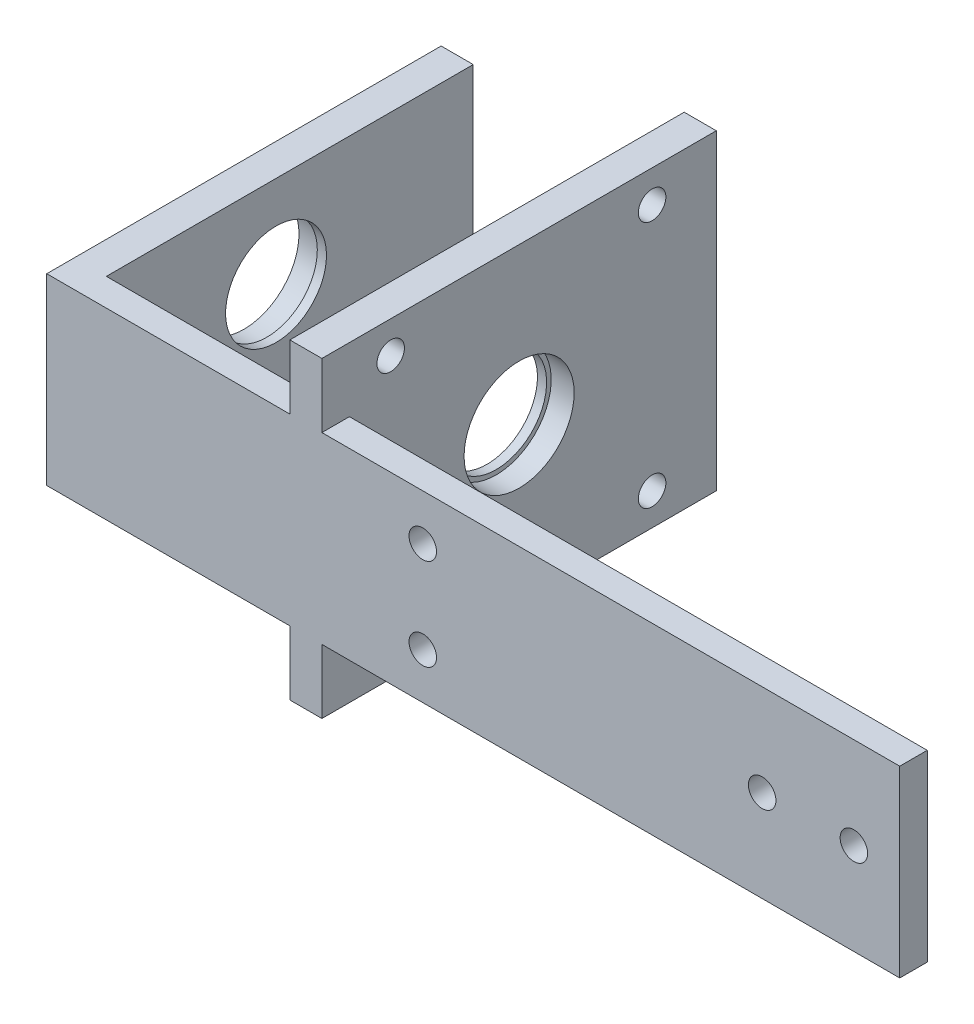
ISO-10303-21;
HEADER;
FILE_DESCRIPTION(('STEP AP214'),'2;1');
FILE_NAME('part.step','',(''),(''),'','','');
FILE_SCHEMA(('AUTOMOTIVE_DESIGN { 1 0 10303 214 1 1 1 1 }'));
ENDSEC;
DATA;
#1=APPLICATION_CONTEXT('core data for automotive mechanical design processes');
#2=APPLICATION_PROTOCOL_DEFINITION('international standard','automotive_design',2000,#1);
#3=PRODUCT_CONTEXT('',#1,'mechanical');
#4=PRODUCT('Part','Part','',(#3));
#5=PRODUCT_RELATED_PRODUCT_CATEGORY('part','',(#4));
#6=PRODUCT_DEFINITION_FORMATION('','',#4);
#7=PRODUCT_DEFINITION_CONTEXT('part definition',#1,'design');
#8=PRODUCT_DEFINITION('design','',#6,#7);
#9=PRODUCT_DEFINITION_SHAPE('','',#8);
#10=(LENGTH_UNIT() NAMED_UNIT(*) SI_UNIT(.MILLI.,.METRE.));
#11=(NAMED_UNIT(*) PLANE_ANGLE_UNIT() SI_UNIT($,.RADIAN.));
#12=(NAMED_UNIT(*) SI_UNIT($,.STERADIAN.) SOLID_ANGLE_UNIT());
#13=UNCERTAINTY_MEASURE_WITH_UNIT(LENGTH_MEASURE(1.E-05),#10,'distance_accuracy_value','');
#14=(GEOMETRIC_REPRESENTATION_CONTEXT(3) GLOBAL_UNCERTAINTY_ASSIGNED_CONTEXT((#13)) GLOBAL_UNIT_ASSIGNED_CONTEXT((#10,
#11,#12)) REPRESENTATION_CONTEXT('',''));
#15=CARTESIAN_POINT('',(0.,0.,0.));
#16=DIRECTION('',(0.,0.,1.));
#17=DIRECTION('',(1.,0.,0.));
#18=AXIS2_PLACEMENT_3D('',#15,#16,#17);
#19=CARTESIAN_POINT('',(-45.,-0.145751311064588,-18.5));
#20=DIRECTION('',(-1.,0.,0.));
#21=DIRECTION('',(0.,0.,1.));
#22=AXIS2_PLACEMENT_3D('',#19,#20,#21);
#23=CYLINDRICAL_SURFACE('',#22,6.);
#24=CARTESIAN_POINT('',(-83.,-0.145751311064588,-18.5));
#25=DIRECTION('',(-1.,0.,0.));
#26=DIRECTION('',(0.,0.,1.));
#27=AXIS2_PLACEMENT_3D('',#24,#25,#26);
#28=CIRCLE('',#27,6.);
#29=CARTESIAN_POINT('',(-83.,-0.145751311064588,-12.5));
#30=VERTEX_POINT('',#29);
#31=EDGE_CURVE('E429',#30,#30,#28,.T.);
#32=ORIENTED_EDGE('',*,*,#31,.T.);
#33=EDGE_LOOP('',(#32));
#34=FACE_BOUND('',#33,.T.);
#35=CARTESIAN_POINT('',(-80.5,-0.145751311064588,-18.5));
#36=DIRECTION('',(1.,0.,0.));
#37=DIRECTION('',(0.,0.,-1.));
#38=AXIS2_PLACEMENT_3D('',#35,#36,#37);
#39=CIRCLE('',#38,6.);
#40=CARTESIAN_POINT('',(-80.5,-0.145751311064588,-24.5));
#41=VERTEX_POINT('',#40);
#42=EDGE_CURVE('E11',#41,#41,#39,.F.);
#43=ORIENTED_EDGE('',*,*,#42,.F.);
#44=EDGE_LOOP('',(#43));
#45=FACE_BOUND('',#44,.T.);
#46=ADVANCED_FACE('F37',(#34,#45),#23,.F.);
#47=CARTESIAN_POINT('',(-53.,-0.145751311064588,-18.5));
#48=DIRECTION('',(1.,0.,0.));
#49=DIRECTION('',(0.,0.,-1.));
#50=AXIS2_PLACEMENT_3D('',#47,#48,#49);
#51=CIRCLE('',#50,6.);
#52=CARTESIAN_POINT('',(-53.,-0.145751311064588,-24.5));
#53=VERTEX_POINT('',#52);
#54=EDGE_CURVE('E163',#53,#53,#51,.T.);
#55=ORIENTED_EDGE('',*,*,#54,.T.);
#56=EDGE_LOOP('',(#55));
#57=FACE_BOUND('',#56,.T.);
#58=CARTESIAN_POINT('',(-55.5,-0.145751311064588,-18.5));
#59=DIRECTION('',(-1.,0.,0.));
#60=DIRECTION('',(0.,0.,1.));
#61=AXIS2_PLACEMENT_3D('',#58,#59,#60);
#62=CIRCLE('',#61,6.);
#63=CARTESIAN_POINT('',(-55.5,-0.145751311064588,-12.5));
#64=VERTEX_POINT('',#63);
#65=EDGE_CURVE('E45',#64,#64,#62,.F.);
#66=ORIENTED_EDGE('',*,*,#65,.F.);
#67=EDGE_LOOP('',(#66));
#68=FACE_BOUND('',#67,.T.);
#69=ADVANCED_FACE('F290',(#57,#68),#23,.F.);
#70=CARTESIAN_POINT('',(0.,0.,0.));
#71=DIRECTION('',(0.,0.,1.));
#72=DIRECTION('',(1.,0.,0.));
#73=AXIS2_PLACEMENT_3D('',#70,#71,#72);
#74=PLANE('',#73);
#75=DIRECTION('',(0.,-1.,0.));
#76=VECTOR('',#75,1.);
#77=CARTESIAN_POINT('',(-79.5,0.,0.));
#78=LINE('',#77,#76);
#79=CARTESIAN_POINT('',(-79.5,9.85424868893541,0.));
#80=VERTEX_POINT('',#79);
#81=CARTESIAN_POINT('',(-79.5,-10.1457513110646,0.));
#82=VERTEX_POINT('',#81);
#83=EDGE_CURVE('E56',#80,#82,#78,.T.);
#84=ORIENTED_EDGE('',*,*,#83,.F.);
#85=DIRECTION('',(-1.,0.,0.));
#86=VECTOR('',#85,1.);
#87=CARTESIAN_POINT('',(0.,9.85424868893541,0.));
#88=LINE('',#87,#86);
#89=CARTESIAN_POINT('',(-56.5,9.85424868893541,0.));
#90=VERTEX_POINT('',#89);
#91=EDGE_CURVE('E244',#90,#80,#88,.T.);
#92=ORIENTED_EDGE('',*,*,#91,.F.);
#93=DIRECTION('',(0.,-1.,0.));
#94=VECTOR('',#93,1.);
#95=CARTESIAN_POINT('',(-56.5,0.,0.));
#96=LINE('',#95,#94);
#97=CARTESIAN_POINT('',(-56.5,-10.1457513110646,0.));
#98=VERTEX_POINT('',#97);
#99=EDGE_CURVE('E204',#90,#98,#96,.T.);
#100=ORIENTED_EDGE('',*,*,#99,.T.);
#101=DIRECTION('',(1.,0.,0.));
#102=VECTOR('',#101,1.);
#103=CARTESIAN_POINT('',(0.,-10.1457513110646,0.));
#104=LINE('',#103,#102);
#105=EDGE_CURVE('E52',#82,#98,#104,.T.);
#106=ORIENTED_EDGE('',*,*,#105,.F.);
#107=EDGE_LOOP('',(#84,#92,#100,#106));
#108=FACE_BOUND('',#107,.T.);
#109=ADVANCED_FACE('F292',(#108),#74,.F.);
#110=CARTESIAN_POINT('',(-42.000000000006,-5.14605105376165,0.));
#111=DIRECTION('',(0.,0.,1.));
#112=DIRECTION('',(1.,0.,0.));
#113=AXIS2_PLACEMENT_3D('',#110,#111,#112);
#114=CIRCLE('',#113,1.5);
#115=CARTESIAN_POINT('',(-40.500000000006,-5.14605105376165,0.));
#116=VERTEX_POINT('',#115);
#117=EDGE_CURVE('E485',#116,#116,#114,.T.);
#118=ORIENTED_EDGE('',*,*,#117,.T.);
#119=EDGE_LOOP('',(#118));
#120=FACE_BOUND('',#119,.T.);
#121=CARTESIAN_POINT('',(-42.000000000006,4.8539489462383,0.));
#122=DIRECTION('',(0.,0.,1.));
#123=DIRECTION('',(1.,0.,0.));
#124=AXIS2_PLACEMENT_3D('',#121,#122,#123);
#125=CIRCLE('',#124,1.5);
#126=CARTESIAN_POINT('',(-40.500000000006,4.8539489462383,0.));
#127=VERTEX_POINT('',#126);
#128=EDGE_CURVE('E417',#127,#127,#125,.T.);
#129=ORIENTED_EDGE('',*,*,#128,.T.);
#130=EDGE_LOOP('',(#129));
#131=FACE_BOUND('',#130,.T.);
#132=CARTESIAN_POINT('',(-5.,-0.145751311064589,0.));
#133=DIRECTION('',(0.,0.,1.));
#134=DIRECTION('',(1.,0.,0.));
#135=AXIS2_PLACEMENT_3D('',#132,#133,#134);
#136=CIRCLE('',#135,1.5);
#137=CARTESIAN_POINT('',(-3.5,-0.145751311064589,0.));
#138=VERTEX_POINT('',#137);
#139=EDGE_CURVE('E213',#138,#138,#136,.T.);
#140=ORIENTED_EDGE('',*,*,#139,.T.);
#141=EDGE_LOOP('',(#140));
#142=FACE_BOUND('',#141,.T.);
#143=CARTESIAN_POINT('',(5.,-0.145751311064589,0.));
#144=DIRECTION('',(0.,0.,1.));
#145=DIRECTION('',(1.,0.,0.));
#146=AXIS2_PLACEMENT_3D('',#143,#144,#145);
#147=CIRCLE('',#146,1.5);
#148=CARTESIAN_POINT('',(6.5,-0.145751311064589,0.));
#149=VERTEX_POINT('',#148);
#150=EDGE_CURVE('E253',#149,#149,#147,.T.);
#151=ORIENTED_EDGE('',*,*,#150,.T.);
#152=EDGE_LOOP('',(#151));
#153=FACE_BOUND('',#152,.T.);
#154=DIRECTION('',(0.,-1.,0.));
#155=VECTOR('',#154,1.);
#156=CARTESIAN_POINT('',(-53.,0.,0.));
#157=LINE('',#156,#155);
#158=CARTESIAN_POINT('',(-53.,9.85424868893541,0.));
#159=VERTEX_POINT('',#158);
#160=CARTESIAN_POINT('',(-53.,-10.1457513110646,0.));
#161=VERTEX_POINT('',#160);
#162=EDGE_CURVE('E206',#159,#161,#157,.T.);
#163=ORIENTED_EDGE('',*,*,#162,.F.);
#164=DIRECTION('',(-1.,0.,0.));
#165=VECTOR('',#164,1.);
#166=CARTESIAN_POINT('',(0.,9.85424868893541,0.));
#167=LINE('',#166,#165);
#168=CARTESIAN_POINT('',(10.,9.85424868893541,0.));
#169=VERTEX_POINT('',#168);
#170=EDGE_CURVE('E203',#169,#159,#167,.T.);
#171=ORIENTED_EDGE('',*,*,#170,.F.);
#172=DIRECTION('',(0.,-1.,0.));
#173=VECTOR('',#172,1.);
#174=CARTESIAN_POINT('',(10.,0.,0.));
#175=LINE('',#174,#173);
#176=CARTESIAN_POINT('',(10.,-10.1457513110646,0.));
#177=VERTEX_POINT('',#176);
#178=EDGE_CURVE('E250',#169,#177,#175,.T.);
#179=ORIENTED_EDGE('',*,*,#178,.T.);
#180=DIRECTION('',(1.,0.,0.));
#181=VECTOR('',#180,1.);
#182=CARTESIAN_POINT('',(0.,-10.1457513110646,0.));
#183=LINE('',#182,#181);
#184=EDGE_CURVE('E247',#161,#177,#183,.T.);
#185=ORIENTED_EDGE('',*,*,#184,.F.);
#186=EDGE_LOOP('',(#163,#171,#179,#185));
#187=FACE_BOUND('',#186,.T.);
#188=ADVANCED_FACE('F299',(#120,#131,#142,#153,#187),#74,.F.);
#189=CARTESIAN_POINT('',(0.,9.85424868893541,3.));
#190=DIRECTION('',(0.,-1.,0.));
#191=DIRECTION('',(0.,0.,-1.));
#192=AXIS2_PLACEMENT_3D('',#189,#190,#191);
#193=PLANE('',#192);
#194=ORIENTED_EDGE('',*,*,#170,.T.);
#195=DIRECTION('',(0.,0.,-1.));
#196=VECTOR('',#195,1.);
#197=CARTESIAN_POINT('',(-53.,9.85424868893541,3.));
#198=LINE('',#197,#196);
#199=CARTESIAN_POINT('',(-53.,9.85424868893541,3.));
#200=VERTEX_POINT('',#199);
#201=EDGE_CURVE('E209',#200,#159,#198,.T.);
#202=ORIENTED_EDGE('',*,*,#201,.F.);
#203=DIRECTION('',(-1.,0.,0.));
#204=VECTOR('',#203,1.);
#205=CARTESIAN_POINT('',(0.,9.85424868893541,3.));
#206=LINE('',#205,#204);
#207=CARTESIAN_POINT('',(10.,9.85424868893541,3.));
#208=VERTEX_POINT('',#207);
#209=EDGE_CURVE('E210',#208,#200,#206,.T.);
#210=ORIENTED_EDGE('',*,*,#209,.F.);
#211=DIRECTION('',(0.,0.,-1.));
#212=VECTOR('',#211,1.);
#213=CARTESIAN_POINT('',(10.,9.85424868893541,3.));
#214=LINE('',#213,#212);
#215=EDGE_CURVE('E241',#208,#169,#214,.T.);
#216=ORIENTED_EDGE('',*,*,#215,.T.);
#217=EDGE_LOOP('',(#194,#202,#210,#216));
#218=FACE_BOUND('',#217,.T.);
#219=ADVANCED_FACE('F39',(#218),#193,.F.);
#220=CARTESIAN_POINT('',(0.,16.8542486889354,3.));
#221=DIRECTION('',(0.,-1.,0.));
#222=DIRECTION('',(0.,0.,-1.));
#223=AXIS2_PLACEMENT_3D('',#220,#221,#222);
#224=PLANE('',#223);
#225=DIRECTION('',(0.,0.,-1.));
#226=VECTOR('',#225,1.);
#227=CARTESIAN_POINT('',(-53.,16.8542486889354,3.));
#228=LINE('',#227,#226);
#229=CARTESIAN_POINT('',(-53.,16.8542486889354,3.));
#230=VERTEX_POINT('',#229);
#231=CARTESIAN_POINT('',(-53.,16.8542486889354,-40.));
#232=VERTEX_POINT('',#231);
#233=EDGE_CURVE('E274',#230,#232,#228,.T.);
#234=ORIENTED_EDGE('',*,*,#233,.T.);
#235=DIRECTION('',(-1.,0.,0.));
#236=VECTOR('',#235,1.);
#237=CARTESIAN_POINT('',(0.,16.8542486889354,-40.));
#238=LINE('',#237,#236);
#239=CARTESIAN_POINT('',(-56.5,16.8542486889354,-40.));
#240=VERTEX_POINT('',#239);
#241=EDGE_CURVE('E200',#232,#240,#238,.T.);
#242=ORIENTED_EDGE('',*,*,#241,.T.);
#243=DIRECTION('',(0.,0.,-1.));
#244=VECTOR('',#243,1.);
#245=CARTESIAN_POINT('',(-56.5,16.8542486889354,3.));
#246=LINE('',#245,#244);
#247=CARTESIAN_POINT('',(-56.5,16.8542486889354,3.));
#248=VERTEX_POINT('',#247);
#249=EDGE_CURVE('E272',#248,#240,#246,.T.);
#250=ORIENTED_EDGE('',*,*,#249,.F.);
#251=DIRECTION('',(-1.,0.,0.));
#252=VECTOR('',#251,1.);
#253=CARTESIAN_POINT('',(0.,16.8542486889354,3.));
#254=LINE('',#253,#252);
#255=EDGE_CURVE('E216',#230,#248,#254,.T.);
#256=ORIENTED_EDGE('',*,*,#255,.F.);
#257=EDGE_LOOP('',(#234,#242,#250,#256));
#258=FACE_BOUND('',#257,.T.);
#259=ADVANCED_FACE('F372',(#258),#224,.F.);
#260=CARTESIAN_POINT('',(0.,9.85424868893541,3.));
#261=DIRECTION('',(0.,-1.,0.));
#262=DIRECTION('',(0.,0.,-1.));
#263=AXIS2_PLACEMENT_3D('',#260,#261,#262);
#264=PLANE('',#263);
#265=ORIENTED_EDGE('',*,*,#91,.T.);
#266=DIRECTION('',(0.,0.,1.));
#267=VECTOR('',#266,1.);
#268=CARTESIAN_POINT('',(-79.5,9.85424868893541,-40.));
#269=LINE('',#268,#267);
#270=CARTESIAN_POINT('',(-79.5,9.85424868893541,-40.));
#271=VERTEX_POINT('',#270);
#272=EDGE_CURVE('E161',#271,#80,#269,.T.);
#273=ORIENTED_EDGE('',*,*,#272,.F.);
#274=DIRECTION('',(1.,0.,0.));
#275=VECTOR('',#274,1.);
#276=CARTESIAN_POINT('',(0.,9.85424868893541,-40.));
#277=LINE('',#276,#275);
#278=CARTESIAN_POINT('',(-83.,9.85424868893541,-40.));
#279=VERTEX_POINT('',#278);
#280=EDGE_CURVE('E154',#279,#271,#277,.T.);
#281=ORIENTED_EDGE('',*,*,#280,.F.);
#282=DIRECTION('',(0.,0.,-1.));
#283=VECTOR('',#282,1.);
#284=CARTESIAN_POINT('',(-83.,9.85424868893541,3.));
#285=LINE('',#284,#283);
#286=CARTESIAN_POINT('',(-83.,9.85424868893541,3.));
#287=VERTEX_POINT('',#286);
#288=EDGE_CURVE('E138',#287,#279,#285,.T.);
#289=ORIENTED_EDGE('',*,*,#288,.F.);
#290=DIRECTION('',(-1.,0.,0.));
#291=VECTOR('',#290,1.);
#292=CARTESIAN_POINT('',(0.,9.85424868893541,3.));
#293=LINE('',#292,#291);
#294=CARTESIAN_POINT('',(-56.5,9.85424868893541,3.));
#295=VERTEX_POINT('',#294);
#296=EDGE_CURVE('E221',#295,#287,#293,.T.);
#297=ORIENTED_EDGE('',*,*,#296,.F.);
#298=DIRECTION('',(0.,0.,-1.));
#299=VECTOR('',#298,1.);
#300=CARTESIAN_POINT('',(-56.5,9.85424868893541,3.));
#301=LINE('',#300,#299);
#302=EDGE_CURVE('E147',#295,#90,#301,.T.);
#303=ORIENTED_EDGE('',*,*,#302,.T.);
#304=EDGE_LOOP('',(#265,#273,#281,#289,#297,#303));
#305=FACE_BOUND('',#304,.T.);
#306=ADVANCED_FACE('F159',(#305),#264,.F.);
#307=CARTESIAN_POINT('',(-83.,0.,3.));
#308=DIRECTION('',(-1.,0.,0.));
#309=DIRECTION('',(0.,0.,1.));
#310=AXIS2_PLACEMENT_3D('',#307,#308,#309);
#311=PLANE('',#310);
#312=ORIENTED_EDGE('',*,*,#31,.F.);
#313=EDGE_LOOP('',(#312));
#314=FACE_BOUND('',#313,.T.);
#315=ORIENTED_EDGE('',*,*,#288,.T.);
#316=DIRECTION('',(0.,1.,0.));
#317=VECTOR('',#316,1.);
#318=CARTESIAN_POINT('',(-83.,0.,-40.));
#319=LINE('',#318,#317);
#320=CARTESIAN_POINT('',(-83.,-10.1457513110646,-40.));
#321=VERTEX_POINT('',#320);
#322=EDGE_CURVE('E141',#321,#279,#319,.T.);
#323=ORIENTED_EDGE('',*,*,#322,.F.);
#324=DIRECTION('',(0.,0.,-1.));
#325=VECTOR('',#324,1.);
#326=CARTESIAN_POINT('',(-83.,-10.1457513110646,3.));
#327=LINE('',#326,#325);
#328=CARTESIAN_POINT('',(-83.,-10.1457513110646,3.));
#329=VERTEX_POINT('',#328);
#330=EDGE_CURVE('E148',#329,#321,#327,.T.);
#331=ORIENTED_EDGE('',*,*,#330,.F.);
#332=DIRECTION('',(0.,1.,0.));
#333=VECTOR('',#332,1.);
#334=CARTESIAN_POINT('',(-83.,0.,3.));
#335=LINE('',#334,#333);
#336=EDGE_CURVE('E143',#329,#287,#335,.T.);
#337=ORIENTED_EDGE('',*,*,#336,.T.);
#338=EDGE_LOOP('',(#315,#323,#331,#337));
#339=FACE_BOUND('',#338,.T.);
#340=ADVANCED_FACE('F140',(#314,#339),#311,.T.);
#341=CARTESIAN_POINT('',(0.,-10.1457513110646,3.));
#342=DIRECTION('',(0.,1.,0.));
#343=DIRECTION('',(0.,0.,1.));
#344=AXIS2_PLACEMENT_3D('',#341,#342,#343);
#345=PLANE('',#344);
#346=ORIENTED_EDGE('',*,*,#330,.T.);
#347=DIRECTION('',(-1.,0.,0.));
#348=VECTOR('',#347,1.);
#349=CARTESIAN_POINT('',(0.,-10.1457513110646,-40.));
#350=LINE('',#349,#348);
#351=CARTESIAN_POINT('',(-79.5,-10.1457513110646,-40.));
#352=VERTEX_POINT('',#351);
#353=EDGE_CURVE('E157',#352,#321,#350,.T.);
#354=ORIENTED_EDGE('',*,*,#353,.F.);
#355=DIRECTION('',(0.,0.,1.));
#356=VECTOR('',#355,1.);
#357=CARTESIAN_POINT('',(-79.5,-10.1457513110646,-40.));
#358=LINE('',#357,#356);
#359=EDGE_CURVE('E170',#352,#82,#358,.T.);
#360=ORIENTED_EDGE('',*,*,#359,.T.);
#361=ORIENTED_EDGE('',*,*,#105,.T.);
#362=DIRECTION('',(0.,0.,-1.));
#363=VECTOR('',#362,1.);
#364=CARTESIAN_POINT('',(-56.5,-10.1457513110646,3.));
#365=LINE('',#364,#363);
#366=CARTESIAN_POINT('',(-56.5,-10.1457513110646,3.));
#367=VERTEX_POINT('',#366);
#368=EDGE_CURVE('E267',#367,#98,#365,.T.);
#369=ORIENTED_EDGE('',*,*,#368,.F.);
#370=DIRECTION('',(1.,0.,0.));
#371=VECTOR('',#370,1.);
#372=CARTESIAN_POINT('',(0.,-10.1457513110646,3.));
#373=LINE('',#372,#371);
#374=EDGE_CURVE('E225',#329,#367,#373,.T.);
#375=ORIENTED_EDGE('',*,*,#374,.F.);
#376=EDGE_LOOP('',(#346,#354,#360,#361,#369,#375));
#377=FACE_BOUND('',#376,.T.);
#378=ADVANCED_FACE('F363',(#377),#345,.F.);
#379=CARTESIAN_POINT('',(-56.5,0.,3.));
#380=DIRECTION('',(1.,0.,0.));
#381=DIRECTION('',(0.,0.,-1.));
#382=AXIS2_PLACEMENT_3D('',#379,#380,#381);
#383=PLANE('',#382);
#384=CARTESIAN_POINT('',(-56.5,13.3542486889354,-4.50000000000005));
#385=DIRECTION('',(1.,0.,0.));
#386=DIRECTION('',(0.,0.,-1.));
#387=AXIS2_PLACEMENT_3D('',#384,#385,#386);
#388=CIRCLE('',#387,1.5);
#389=CARTESIAN_POINT('',(-56.5,13.3542486889354,-6.00000000000005));
#390=VERTEX_POINT('',#389);
#391=EDGE_CURVE('E184',#390,#390,#388,.T.);
#392=ORIENTED_EDGE('',*,*,#391,.T.);
#393=EDGE_LOOP('',(#392));
#394=FACE_BOUND('',#393,.T.);
#395=CARTESIAN_POINT('',(-56.5,-13.6457513110646,-33.));
#396=DIRECTION('',(1.,0.,0.));
#397=DIRECTION('',(0.,0.,-1.));
#398=AXIS2_PLACEMENT_3D('',#395,#396,#397);
#399=CIRCLE('',#398,1.5);
#400=CARTESIAN_POINT('',(-56.5,-13.6457513110646,-34.5));
#401=VERTEX_POINT('',#400);
#402=EDGE_CURVE('E180',#401,#401,#399,.T.);
#403=ORIENTED_EDGE('',*,*,#402,.T.);
#404=EDGE_LOOP('',(#403));
#405=FACE_BOUND('',#404,.T.);
#406=CARTESIAN_POINT('',(-56.5,-13.6457513110646,-4.50000000000005));
#407=DIRECTION('',(1.,0.,0.));
#408=DIRECTION('',(0.,0.,-1.));
#409=AXIS2_PLACEMENT_3D('',#406,#407,#408);
#410=CIRCLE('',#409,1.5);
#411=CARTESIAN_POINT('',(-56.5,-13.6457513110646,-6.00000000000005));
#412=VERTEX_POINT('',#411);
#413=EDGE_CURVE('E176',#412,#412,#410,.T.);
#414=ORIENTED_EDGE('',*,*,#413,.T.);
#415=EDGE_LOOP('',(#414));
#416=FACE_BOUND('',#415,.T.);
#417=CARTESIAN_POINT('',(-56.5,13.3542486889354,-33.));
#418=DIRECTION('',(1.,0.,0.));
#419=DIRECTION('',(0.,0.,-1.));
#420=AXIS2_PLACEMENT_3D('',#417,#418,#419);
#421=CIRCLE('',#420,1.5);
#422=CARTESIAN_POINT('',(-56.5,13.3542486889354,-34.5));
#423=VERTEX_POINT('',#422);
#424=EDGE_CURVE('E188',#423,#423,#421,.T.);
#425=ORIENTED_EDGE('',*,*,#424,.T.);
#426=EDGE_LOOP('',(#425));
#427=FACE_BOUND('',#426,.T.);
#428=ORIENTED_EDGE('',*,*,#368,.T.);
#429=ORIENTED_EDGE('',*,*,#99,.F.);
#430=ORIENTED_EDGE('',*,*,#302,.F.);
#431=DIRECTION('',(0.,-1.,0.));
#432=VECTOR('',#431,1.);
#433=CARTESIAN_POINT('',(-56.5,0.,3.));
#434=LINE('',#433,#432);
#435=EDGE_CURVE('E219',#248,#295,#434,.T.);
#436=ORIENTED_EDGE('',*,*,#435,.F.);
#437=ORIENTED_EDGE('',*,*,#249,.T.);
#438=DIRECTION('',(0.,-1.,0.));
#439=VECTOR('',#438,1.);
#440=CARTESIAN_POINT('',(-56.5,0.,-40.));
#441=LINE('',#440,#439);
#442=CARTESIAN_POINT('',(-56.5,-17.1457513110646,-40.));
#443=VERTEX_POINT('',#442);
#444=EDGE_CURVE('E191',#240,#443,#441,.T.);
#445=ORIENTED_EDGE('',*,*,#444,.T.);
#446=DIRECTION('',(0.,0.,-1.));
#447=VECTOR('',#446,1.);
#448=CARTESIAN_POINT('',(-56.5,-17.1457513110646,3.));
#449=LINE('',#448,#447);
#450=CARTESIAN_POINT('',(-56.5,-17.1457513110646,3.));
#451=VERTEX_POINT('',#450);
#452=EDGE_CURVE('E265',#451,#443,#449,.T.);
#453=ORIENTED_EDGE('',*,*,#452,.F.);
#454=EDGE_CURVE('E222',#367,#451,#434,.T.);
#455=ORIENTED_EDGE('',*,*,#454,.F.);
#456=EDGE_LOOP('',(#428,#429,#430,#436,#437,#445,#453,#455));
#457=FACE_BOUND('',#456,.T.);
#458=CARTESIAN_POINT('',(-56.5,-0.145751311064588,-18.5));
#459=DIRECTION('',(-1.,0.,0.));
#460=DIRECTION('',(0.,0.,1.));
#461=AXIS2_PLACEMENT_3D('',#458,#459,#460);
#462=CIRCLE('',#461,5.5);
#463=CARTESIAN_POINT('',(-56.5,-0.145751311064588,-13.));
#464=VERTEX_POINT('',#463);
#465=EDGE_CURVE('E420',#464,#464,#462,.T.);
#466=ORIENTED_EDGE('',*,*,#465,.F.);
#467=EDGE_LOOP('',(#466));
#468=FACE_BOUND('',#467,.T.);
#469=ADVANCED_FACE('F359',(#394,#405,#416,#427,#457,#468),#383,.F.);
#470=CARTESIAN_POINT('',(0.,-17.1457513110646,3.));
#471=DIRECTION('',(0.,-1.,0.));
#472=DIRECTION('',(1.,0.,0.));
#473=AXIS2_PLACEMENT_3D('',#470,#471,#472);
#474=PLANE('',#473);
#475=ORIENTED_EDGE('',*,*,#452,.T.);
#476=DIRECTION('',(-1.,0.,0.));
#477=VECTOR('',#476,1.);
#478=CARTESIAN_POINT('',(0.,-17.1457513110646,-40.));
#479=LINE('',#478,#477);
#480=CARTESIAN_POINT('',(-53.,-17.1457513110646,-40.));
#481=VERTEX_POINT('',#480);
#482=EDGE_CURVE('E194',#481,#443,#479,.T.);
#483=ORIENTED_EDGE('',*,*,#482,.F.);
#484=DIRECTION('',(0.,0.,-1.));
#485=VECTOR('',#484,1.);
#486=CARTESIAN_POINT('',(-53.,-17.1457513110646,3.));
#487=LINE('',#486,#485);
#488=CARTESIAN_POINT('',(-53.,-17.1457513110646,3.));
#489=VERTEX_POINT('',#488);
#490=EDGE_CURVE('E263',#489,#481,#487,.T.);
#491=ORIENTED_EDGE('',*,*,#490,.F.);
#492=DIRECTION('',(-1.,0.,0.));
#493=VECTOR('',#492,1.);
#494=CARTESIAN_POINT('',(0.,-17.1457513110646,3.));
#495=LINE('',#494,#493);
#496=EDGE_CURVE('E227',#489,#451,#495,.T.);
#497=ORIENTED_EDGE('',*,*,#496,.T.);
#498=EDGE_LOOP('',(#475,#483,#491,#497));
#499=FACE_BOUND('',#498,.T.);
#500=ADVANCED_FACE('F355',(#499),#474,.T.);
#501=CARTESIAN_POINT('',(-53.,0.,3.));
#502=DIRECTION('',(1.,0.,0.));
#503=DIRECTION('',(0.,0.,-1.));
#504=AXIS2_PLACEMENT_3D('',#501,#502,#503);
#505=PLANE('',#504);
#506=ORIENTED_EDGE('',*,*,#54,.F.);
#507=EDGE_LOOP('',(#506));
#508=FACE_BOUND('',#507,.T.);
#509=CARTESIAN_POINT('',(-53.,13.3542486889354,-4.50000000000005));
#510=DIRECTION('',(1.,0.,0.));
#511=DIRECTION('',(0.,0.,-1.));
#512=AXIS2_PLACEMENT_3D('',#509,#510,#511);
#513=CIRCLE('',#512,1.5);
#514=CARTESIAN_POINT('',(-53.,13.3542486889354,-6.00000000000005));
#515=VERTEX_POINT('',#514);
#516=EDGE_CURVE('E183',#515,#515,#513,.T.);
#517=ORIENTED_EDGE('',*,*,#516,.F.);
#518=EDGE_LOOP('',(#517));
#519=FACE_BOUND('',#518,.T.);
#520=CARTESIAN_POINT('',(-53.,-13.6457513110646,-33.));
#521=DIRECTION('',(1.,0.,0.));
#522=DIRECTION('',(0.,0.,-1.));
#523=AXIS2_PLACEMENT_3D('',#520,#521,#522);
#524=CIRCLE('',#523,1.5);
#525=CARTESIAN_POINT('',(-53.,-13.6457513110646,-34.5));
#526=VERTEX_POINT('',#525);
#527=EDGE_CURVE('E179',#526,#526,#524,.T.);
#528=ORIENTED_EDGE('',*,*,#527,.F.);
#529=EDGE_LOOP('',(#528));
#530=FACE_BOUND('',#529,.T.);
#531=CARTESIAN_POINT('',(-53.,-13.6457513110646,-4.50000000000005));
#532=DIRECTION('',(1.,0.,0.));
#533=DIRECTION('',(0.,0.,-1.));
#534=AXIS2_PLACEMENT_3D('',#531,#532,#533);
#535=CIRCLE('',#534,1.5);
#536=CARTESIAN_POINT('',(-53.,-13.6457513110646,-6.00000000000005));
#537=VERTEX_POINT('',#536);
#538=EDGE_CURVE('E173',#537,#537,#535,.T.);
#539=ORIENTED_EDGE('',*,*,#538,.F.);
#540=EDGE_LOOP('',(#539));
#541=FACE_BOUND('',#540,.T.);
#542=CARTESIAN_POINT('',(-53.,13.3542486889354,-33.));
#543=DIRECTION('',(1.,0.,0.));
#544=DIRECTION('',(0.,0.,-1.));
#545=AXIS2_PLACEMENT_3D('',#542,#543,#544);
#546=CIRCLE('',#545,1.5);
#547=CARTESIAN_POINT('',(-53.,13.3542486889354,-34.5));
#548=VERTEX_POINT('',#547);
#549=EDGE_CURVE('E187',#548,#548,#546,.T.);
#550=ORIENTED_EDGE('',*,*,#549,.F.);
#551=EDGE_LOOP('',(#550));
#552=FACE_BOUND('',#551,.T.);
#553=ORIENTED_EDGE('',*,*,#490,.T.);
#554=DIRECTION('',(0.,-1.,0.));
#555=VECTOR('',#554,1.);
#556=CARTESIAN_POINT('',(-53.,0.,-40.));
#557=LINE('',#556,#555);
#558=EDGE_CURVE('E197',#232,#481,#557,.T.);
#559=ORIENTED_EDGE('',*,*,#558,.F.);
#560=ORIENTED_EDGE('',*,*,#233,.F.);
#561=DIRECTION('',(0.,-1.,0.));
#562=VECTOR('',#561,1.);
#563=CARTESIAN_POINT('',(-53.,0.,3.));
#564=LINE('',#563,#562);
#565=EDGE_CURVE('E212',#230,#200,#564,.T.);
#566=ORIENTED_EDGE('',*,*,#565,.T.);
#567=ORIENTED_EDGE('',*,*,#201,.T.);
#568=ORIENTED_EDGE('',*,*,#162,.T.);
#569=DIRECTION('',(0.,0.,-1.));
#570=VECTOR('',#569,1.);
#571=CARTESIAN_POINT('',(-53.,-10.1457513110646,3.));
#572=LINE('',#571,#570);
#573=CARTESIAN_POINT('',(-53.,-10.1457513110646,3.));
#574=VERTEX_POINT('',#573);
#575=EDGE_CURVE('E261',#574,#161,#572,.T.);
#576=ORIENTED_EDGE('',*,*,#575,.F.);
#577=EDGE_CURVE('E217',#574,#489,#564,.T.);
#578=ORIENTED_EDGE('',*,*,#577,.T.);
#579=EDGE_LOOP('',(#553,#559,#560,#566,#567,#568,#576,#578));
#580=FACE_BOUND('',#579,.T.);
#581=ADVANCED_FACE('F351',(#508,#519,#530,#541,#552,#580),#505,.T.);
#582=CARTESIAN_POINT('',(0.,-10.1457513110646,3.));
#583=DIRECTION('',(0.,1.,0.));
#584=DIRECTION('',(0.,0.,1.));
#585=AXIS2_PLACEMENT_3D('',#582,#583,#584);
#586=PLANE('',#585);
#587=ORIENTED_EDGE('',*,*,#184,.T.);
#588=DIRECTION('',(0.,0.,-1.));
#589=VECTOR('',#588,1.);
#590=CARTESIAN_POINT('',(10.,-10.1457513110646,3.));
#591=LINE('',#590,#589);
#592=CARTESIAN_POINT('',(10.,-10.1457513110646,3.));
#593=VERTEX_POINT('',#592);
#594=EDGE_CURVE('E259',#593,#177,#591,.T.);
#595=ORIENTED_EDGE('',*,*,#594,.F.);
#596=DIRECTION('',(1.,0.,0.));
#597=VECTOR('',#596,1.);
#598=CARTESIAN_POINT('',(0.,-10.1457513110646,3.));
#599=LINE('',#598,#597);
#600=EDGE_CURVE('E230',#574,#593,#599,.T.);
#601=ORIENTED_EDGE('',*,*,#600,.F.);
#602=ORIENTED_EDGE('',*,*,#575,.T.);
#603=EDGE_LOOP('',(#587,#595,#601,#602));
#604=FACE_BOUND('',#603,.T.);
#605=ADVANCED_FACE('F344',(#604),#586,.F.);
#606=CARTESIAN_POINT('',(5.,-0.145751311064589,3.));
#607=DIRECTION('',(0.,0.,-1.));
#608=DIRECTION('',(-1.,0.,0.));
#609=AXIS2_PLACEMENT_3D('',#606,#607,#608);
#610=CYLINDRICAL_SURFACE('',#609,1.5);
#611=CARTESIAN_POINT('',(5.,-0.145751311064589,3.));
#612=DIRECTION('',(0.,0.,1.));
#613=DIRECTION('',(1.,0.,0.));
#614=AXIS2_PLACEMENT_3D('',#611,#612,#613);
#615=CIRCLE('',#614,1.5);
#616=CARTESIAN_POINT('',(6.5,-0.145751311064589,3.));
#617=VERTEX_POINT('',#616);
#618=EDGE_CURVE('E235',#617,#617,#615,.T.);
#619=ORIENTED_EDGE('',*,*,#618,.T.);
#620=EDGE_LOOP('',(#619));
#621=FACE_BOUND('',#620,.T.);
#622=ORIENTED_EDGE('',*,*,#150,.F.);
#623=EDGE_LOOP('',(#622));
#624=FACE_BOUND('',#623,.T.);
#625=ADVANCED_FACE('F341',(#621,#624),#610,.F.);
#626=CARTESIAN_POINT('',(10.,0.,3.));
#627=DIRECTION('',(1.,0.,0.));
#628=DIRECTION('',(0.,0.,-1.));
#629=AXIS2_PLACEMENT_3D('',#626,#627,#628);
#630=PLANE('',#629);
#631=ORIENTED_EDGE('',*,*,#178,.F.);
#632=ORIENTED_EDGE('',*,*,#215,.F.);
#633=DIRECTION('',(0.,-1.,0.));
#634=VECTOR('',#633,1.);
#635=CARTESIAN_POINT('',(10.,0.,3.));
#636=LINE('',#635,#634);
#637=EDGE_CURVE('E232',#208,#593,#636,.T.);
#638=ORIENTED_EDGE('',*,*,#637,.T.);
#639=ORIENTED_EDGE('',*,*,#594,.T.);
#640=EDGE_LOOP('',(#631,#632,#638,#639));
#641=FACE_BOUND('',#640,.T.);
#642=ADVANCED_FACE('F339',(#641),#630,.T.);
#643=CARTESIAN_POINT('',(-5.,-0.145751311064589,3.));
#644=DIRECTION('',(0.,0.,-1.));
#645=DIRECTION('',(-1.,0.,0.));
#646=AXIS2_PLACEMENT_3D('',#643,#644,#645);
#647=CYLINDRICAL_SURFACE('',#646,1.5);
#648=CARTESIAN_POINT('',(-5.,-0.145751311064589,3.));
#649=DIRECTION('',(0.,0.,1.));
#650=DIRECTION('',(1.,0.,0.));
#651=AXIS2_PLACEMENT_3D('',#648,#649,#650);
#652=CIRCLE('',#651,1.5);
#653=CARTESIAN_POINT('',(-3.5,-0.145751311064589,3.));
#654=VERTEX_POINT('',#653);
#655=EDGE_CURVE('E238',#654,#654,#652,.T.);
#656=ORIENTED_EDGE('',*,*,#655,.T.);
#657=EDGE_LOOP('',(#656));
#658=FACE_BOUND('',#657,.T.);
#659=ORIENTED_EDGE('',*,*,#139,.F.);
#660=EDGE_LOOP('',(#659));
#661=FACE_BOUND('',#660,.T.);
#662=ADVANCED_FACE('F334',(#658,#661),#647,.F.);
#663=CARTESIAN_POINT('',(0.,0.,3.));
#664=DIRECTION('',(0.,0.,1.));
#665=DIRECTION('',(1.,0.,0.));
#666=AXIS2_PLACEMENT_3D('',#663,#664,#665);
#667=PLANE('',#666);
#668=CARTESIAN_POINT('',(-42.000000000006,-5.14605105376165,3.));
#669=DIRECTION('',(0.,0.,1.));
#670=DIRECTION('',(1.,0.,0.));
#671=AXIS2_PLACEMENT_3D('',#668,#669,#670);
#672=CIRCLE('',#671,1.5);
#673=CARTESIAN_POINT('',(-40.500000000006,-5.14605105376165,3.));
#674=VERTEX_POINT('',#673);
#675=EDGE_CURVE('E482',#674,#674,#672,.T.);
#676=ORIENTED_EDGE('',*,*,#675,.F.);
#677=EDGE_LOOP('',(#676));
#678=FACE_BOUND('',#677,.T.);
#679=CARTESIAN_POINT('',(-42.000000000006,4.8539489462383,3.));
#680=DIRECTION('',(0.,0.,1.));
#681=DIRECTION('',(1.,0.,0.));
#682=AXIS2_PLACEMENT_3D('',#679,#680,#681);
#683=CIRCLE('',#682,1.5);
#684=CARTESIAN_POINT('',(-40.500000000006,4.8539489462383,3.));
#685=VERTEX_POINT('',#684);
#686=EDGE_CURVE('E423',#685,#685,#683,.T.);
#687=ORIENTED_EDGE('',*,*,#686,.F.);
#688=EDGE_LOOP('',(#687));
#689=FACE_BOUND('',#688,.T.);
#690=ORIENTED_EDGE('',*,*,#209,.T.);
#691=ORIENTED_EDGE('',*,*,#565,.F.);
#692=ORIENTED_EDGE('',*,*,#255,.T.);
#693=ORIENTED_EDGE('',*,*,#435,.T.);
#694=ORIENTED_EDGE('',*,*,#296,.T.);
#695=ORIENTED_EDGE('',*,*,#336,.F.);
#696=ORIENTED_EDGE('',*,*,#374,.T.);
#697=ORIENTED_EDGE('',*,*,#454,.T.);
#698=ORIENTED_EDGE('',*,*,#496,.F.);
#699=ORIENTED_EDGE('',*,*,#577,.F.);
#700=ORIENTED_EDGE('',*,*,#600,.T.);
#701=ORIENTED_EDGE('',*,*,#637,.F.);
#702=EDGE_LOOP('',(#690,#691,#692,#693,#694,#695,#696,#697,#698,#699,#700,#701));
#703=FACE_BOUND('',#702,.T.);
#704=ORIENTED_EDGE('',*,*,#618,.F.);
#705=EDGE_LOOP('',(#704));
#706=FACE_BOUND('',#705,.T.);
#707=ORIENTED_EDGE('',*,*,#655,.F.);
#708=EDGE_LOOP('',(#707));
#709=FACE_BOUND('',#708,.T.);
#710=ADVANCED_FACE('F331',(#678,#689,#703,#706,#709),#667,.T.);
#711=CARTESIAN_POINT('',(0.,0.,-40.));
#712=DIRECTION('',(0.,0.,1.));
#713=DIRECTION('',(1.,0.,0.));
#714=AXIS2_PLACEMENT_3D('',#711,#712,#713);
#715=PLANE('',#714);
#716=ORIENTED_EDGE('',*,*,#444,.F.);
#717=ORIENTED_EDGE('',*,*,#241,.F.);
#718=ORIENTED_EDGE('',*,*,#558,.T.);
#719=ORIENTED_EDGE('',*,*,#482,.T.);
#720=EDGE_LOOP('',(#716,#717,#718,#719));
#721=FACE_BOUND('',#720,.T.);
#722=ADVANCED_FACE('F327',(#721),#715,.F.);
#723=CARTESIAN_POINT('',(-43.,13.3542486889354,-33.));
#724=DIRECTION('',(-1.,0.,0.));
#725=DIRECTION('',(0.,0.,1.));
#726=AXIS2_PLACEMENT_3D('',#723,#724,#725);
#727=CYLINDRICAL_SURFACE('',#726,1.5);
#728=ORIENTED_EDGE('',*,*,#549,.T.);
#729=EDGE_LOOP('',(#728));
#730=FACE_BOUND('',#729,.T.);
#731=ORIENTED_EDGE('',*,*,#424,.F.);
#732=EDGE_LOOP('',(#731));
#733=FACE_BOUND('',#732,.T.);
#734=ADVANCED_FACE('F323',(#730,#733),#727,.F.);
#735=CARTESIAN_POINT('',(-43.,-13.6457513110646,-4.50000000000005));
#736=DIRECTION('',(-1.,0.,0.));
#737=DIRECTION('',(0.,0.,1.));
#738=AXIS2_PLACEMENT_3D('',#735,#736,#737);
#739=CYLINDRICAL_SURFACE('',#738,1.5);
#740=ORIENTED_EDGE('',*,*,#538,.T.);
#741=EDGE_LOOP('',(#740));
#742=FACE_BOUND('',#741,.T.);
#743=ORIENTED_EDGE('',*,*,#413,.F.);
#744=EDGE_LOOP('',(#743));
#745=FACE_BOUND('',#744,.T.);
#746=ADVANCED_FACE('F316',(#742,#745),#739,.F.);
#747=CARTESIAN_POINT('',(-43.,-13.6457513110646,-33.));
#748=DIRECTION('',(-1.,0.,0.));
#749=DIRECTION('',(0.,0.,1.));
#750=AXIS2_PLACEMENT_3D('',#747,#748,#749);
#751=CYLINDRICAL_SURFACE('',#750,1.5);
#752=ORIENTED_EDGE('',*,*,#527,.T.);
#753=EDGE_LOOP('',(#752));
#754=FACE_BOUND('',#753,.T.);
#755=ORIENTED_EDGE('',*,*,#402,.F.);
#756=EDGE_LOOP('',(#755));
#757=FACE_BOUND('',#756,.T.);
#758=ADVANCED_FACE('F313',(#754,#757),#751,.F.);
#759=CARTESIAN_POINT('',(-43.,13.3542486889354,-4.50000000000005));
#760=DIRECTION('',(-1.,0.,0.));
#761=DIRECTION('',(0.,0.,1.));
#762=AXIS2_PLACEMENT_3D('',#759,#760,#761);
#763=CYLINDRICAL_SURFACE('',#762,1.5);
#764=ORIENTED_EDGE('',*,*,#516,.T.);
#765=EDGE_LOOP('',(#764));
#766=FACE_BOUND('',#765,.T.);
#767=ORIENTED_EDGE('',*,*,#391,.F.);
#768=EDGE_LOOP('',(#767));
#769=FACE_BOUND('',#768,.T.);
#770=ADVANCED_FACE('F311',(#766,#769),#763,.F.);
#771=CARTESIAN_POINT('',(-79.5,0.,-40.));
#772=DIRECTION('',(-1.,0.,0.));
#773=DIRECTION('',(0.,0.,1.));
#774=AXIS2_PLACEMENT_3D('',#771,#772,#773);
#775=PLANE('',#774);
#776=ORIENTED_EDGE('',*,*,#83,.T.);
#777=ORIENTED_EDGE('',*,*,#359,.F.);
#778=DIRECTION('',(0.,-1.,0.));
#779=VECTOR('',#778,1.);
#780=CARTESIAN_POINT('',(-79.5,0.,-40.));
#781=LINE('',#780,#779);
#782=EDGE_CURVE('E169',#271,#352,#781,.T.);
#783=ORIENTED_EDGE('',*,*,#782,.F.);
#784=ORIENTED_EDGE('',*,*,#272,.T.);
#785=EDGE_LOOP('',(#776,#777,#783,#784));
#786=FACE_BOUND('',#785,.T.);
#787=CARTESIAN_POINT('',(-79.5,-0.145751311064588,-18.5));
#788=DIRECTION('',(1.,0.,0.));
#789=DIRECTION('',(0.,0.,-1.));
#790=AXIS2_PLACEMENT_3D('',#787,#788,#789);
#791=CIRCLE('',#790,5.5);
#792=CARTESIAN_POINT('',(-79.5,-0.145751311064588,-24.));
#793=VERTEX_POINT('',#792);
#794=EDGE_CURVE('E414',#793,#793,#791,.T.);
#795=ORIENTED_EDGE('',*,*,#794,.F.);
#796=EDGE_LOOP('',(#795));
#797=FACE_BOUND('',#796,.T.);
#798=ADVANCED_FACE('F308',(#786,#797),#775,.F.);
#799=CARTESIAN_POINT('',(0.,0.,-40.));
#800=DIRECTION('',(0.,0.,1.));
#801=DIRECTION('',(1.,0.,0.));
#802=AXIS2_PLACEMENT_3D('',#799,#800,#801);
#803=PLANE('',#802);
#804=ORIENTED_EDGE('',*,*,#280,.T.);
#805=ORIENTED_EDGE('',*,*,#782,.T.);
#806=ORIENTED_EDGE('',*,*,#353,.T.);
#807=ORIENTED_EDGE('',*,*,#322,.T.);
#808=EDGE_LOOP('',(#804,#805,#806,#807));
#809=FACE_BOUND('',#808,.T.);
#810=ADVANCED_FACE('F153',(#809),#803,.F.);
#811=CARTESIAN_POINT('',(-55.5,-0.145751311064588,-18.5));
#812=DIRECTION('',(-1.,0.,0.));
#813=DIRECTION('',(0.,0.,1.));
#814=AXIS2_PLACEMENT_3D('',#811,#812,#813);
#815=PLANE('',#814);
#816=CARTESIAN_POINT('',(-55.5,-0.145751311064588,-18.5));
#817=DIRECTION('',(-1.,0.,0.));
#818=DIRECTION('',(0.,0.,1.));
#819=AXIS2_PLACEMENT_3D('',#816,#817,#818);
#820=CIRCLE('',#819,5.5);
#821=CARTESIAN_POINT('',(-55.5,-0.145751311064588,-13.));
#822=VERTEX_POINT('',#821);
#823=EDGE_CURVE('E426',#822,#822,#820,.T.);
#824=ORIENTED_EDGE('',*,*,#823,.T.);
#825=EDGE_LOOP('',(#824));
#826=FACE_BOUND('',#825,.T.);
#827=ORIENTED_EDGE('',*,*,#65,.T.);
#828=EDGE_LOOP('',(#827));
#829=FACE_BOUND('',#828,.T.);
#830=ADVANCED_FACE('F288',(#826,#829),#815,.F.);
#831=CARTESIAN_POINT('',(-55.5,-0.145751311064588,-18.5));
#832=DIRECTION('',(-1.,0.,0.));
#833=DIRECTION('',(0.,0.,1.));
#834=AXIS2_PLACEMENT_3D('',#831,#832,#833);
#835=CYLINDRICAL_SURFACE('',#834,5.5);
#836=ORIENTED_EDGE('',*,*,#823,.F.);
#837=EDGE_LOOP('',(#836));
#838=FACE_BOUND('',#837,.T.);
#839=ORIENTED_EDGE('',*,*,#465,.T.);
#840=EDGE_LOOP('',(#839));
#841=FACE_BOUND('',#840,.T.);
#842=ADVANCED_FACE('F459',(#838,#841),#835,.F.);
#843=CARTESIAN_POINT('',(-80.5,-0.145751311064588,-18.5));
#844=DIRECTION('',(1.,0.,0.));
#845=DIRECTION('',(0.,0.,-1.));
#846=AXIS2_PLACEMENT_3D('',#843,#844,#845);
#847=PLANE('',#846);
#848=CARTESIAN_POINT('',(-80.5,-0.145751311064588,-18.5));
#849=DIRECTION('',(1.,0.,0.));
#850=DIRECTION('',(0.,0.,-1.));
#851=AXIS2_PLACEMENT_3D('',#848,#849,#850);
#852=CIRCLE('',#851,5.5);
#853=CARTESIAN_POINT('',(-80.5,-0.145751311064588,-24.));
#854=VERTEX_POINT('',#853);
#855=EDGE_CURVE('E416',#854,#854,#852,.T.);
#856=ORIENTED_EDGE('',*,*,#855,.T.);
#857=EDGE_LOOP('',(#856));
#858=FACE_BOUND('',#857,.T.);
#859=ORIENTED_EDGE('',*,*,#42,.T.);
#860=EDGE_LOOP('',(#859));
#861=FACE_BOUND('',#860,.T.);
#862=ADVANCED_FACE('F456',(#858,#861),#847,.F.);
#863=CARTESIAN_POINT('',(-80.5,-0.145751311064588,-18.5));
#864=DIRECTION('',(1.,0.,0.));
#865=DIRECTION('',(0.,0.,-1.));
#866=AXIS2_PLACEMENT_3D('',#863,#864,#865);
#867=CYLINDRICAL_SURFACE('',#866,5.5);
#868=ORIENTED_EDGE('',*,*,#855,.F.);
#869=EDGE_LOOP('',(#868));
#870=FACE_BOUND('',#869,.T.);
#871=ORIENTED_EDGE('',*,*,#794,.T.);
#872=EDGE_LOOP('',(#871));
#873=FACE_BOUND('',#872,.T.);
#874=ADVANCED_FACE('F458',(#870,#873),#867,.F.);
#875=CARTESIAN_POINT('',(-42.000000000006,4.8539489462383,-2.));
#876=DIRECTION('',(0.,0.,1.));
#877=DIRECTION('',(1.,0.,0.));
#878=AXIS2_PLACEMENT_3D('',#875,#876,#877);
#879=CYLINDRICAL_SURFACE('',#878,1.5);
#880=ORIENTED_EDGE('',*,*,#686,.T.);
#881=EDGE_LOOP('',(#880));
#882=FACE_BOUND('',#881,.T.);
#883=ORIENTED_EDGE('',*,*,#128,.F.);
#884=EDGE_LOOP('',(#883));
#885=FACE_BOUND('',#884,.T.);
#886=ADVANCED_FACE('F466',(#882,#885),#879,.F.);
#887=CARTESIAN_POINT('',(-42.000000000006,-5.14605105376165,-2.));
#888=DIRECTION('',(0.,0.,1.));
#889=DIRECTION('',(1.,0.,0.));
#890=AXIS2_PLACEMENT_3D('',#887,#888,#889);
#891=CYLINDRICAL_SURFACE('',#890,1.5);
#892=ORIENTED_EDGE('',*,*,#675,.T.);
#893=EDGE_LOOP('',(#892));
#894=FACE_BOUND('',#893,.T.);
#895=ORIENTED_EDGE('',*,*,#117,.F.);
#896=EDGE_LOOP('',(#895));
#897=FACE_BOUND('',#896,.T.);
#898=ADVANCED_FACE('F473',(#894,#897),#891,.F.);
#899=CLOSED_SHELL('',(#46,#69,#109,#188,#219,#259,#306,#340,#378,#469,#500,#581,#605,#625,#642,
#662,#710,#722,#734,#746,#758,#770,#798,#810,#830,#842,#862,#874,#886,#898));
#900=MANIFOLD_SOLID_BREP('B2',#899);
#901=ADVANCED_BREP_SHAPE_REPRESENTATION('',(#18,#900),#14);
#902=SHAPE_DEFINITION_REPRESENTATION(#9,#901);
ENDSEC;
END-ISO-10303-21;
